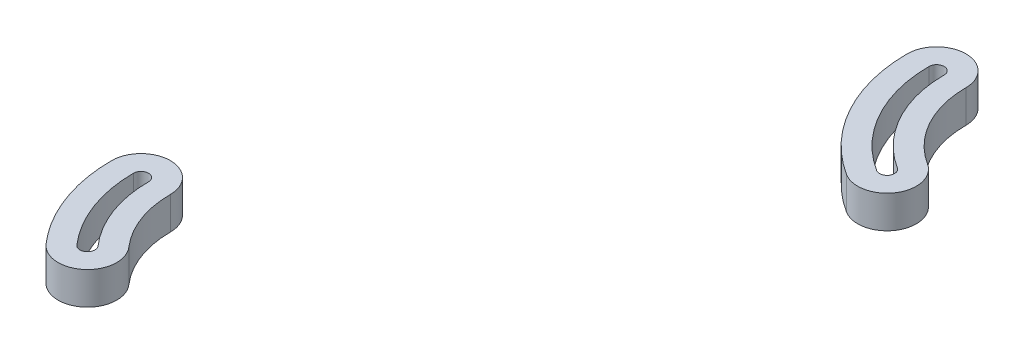
ISO-10303-21;
HEADER;
FILE_DESCRIPTION(('STEP AP214'),'2;1');
FILE_NAME('part.step','',(''),(''),'','','');
FILE_SCHEMA(('AUTOMOTIVE_DESIGN { 1 0 10303 214 1 1 1 1 }'));
ENDSEC;
DATA;
#1=APPLICATION_CONTEXT('core data for automotive mechanical design processes');
#2=APPLICATION_PROTOCOL_DEFINITION('international standard','automotive_design',2000,#1);
#3=PRODUCT_CONTEXT('',#1,'mechanical');
#4=PRODUCT('Part','Part','',(#3));
#5=PRODUCT_RELATED_PRODUCT_CATEGORY('part','',(#4));
#6=PRODUCT_DEFINITION_FORMATION('','',#4);
#7=PRODUCT_DEFINITION_CONTEXT('part definition',#1,'design');
#8=PRODUCT_DEFINITION('design','',#6,#7);
#9=PRODUCT_DEFINITION_SHAPE('','',#8);
#10=(LENGTH_UNIT() NAMED_UNIT(*) SI_UNIT(.MILLI.,.METRE.));
#11=(NAMED_UNIT(*) PLANE_ANGLE_UNIT() SI_UNIT($,.RADIAN.));
#12=(NAMED_UNIT(*) SI_UNIT($,.STERADIAN.) SOLID_ANGLE_UNIT());
#13=UNCERTAINTY_MEASURE_WITH_UNIT(LENGTH_MEASURE(1.E-05),#10,'distance_accuracy_value','');
#14=(GEOMETRIC_REPRESENTATION_CONTEXT(3) GLOBAL_UNCERTAINTY_ASSIGNED_CONTEXT((#13)) GLOBAL_UNIT_ASSIGNED_CONTEXT((#10,
#11,#12)) REPRESENTATION_CONTEXT('',''));
#15=CARTESIAN_POINT('',(0.,0.,0.));
#16=DIRECTION('',(0.,0.,1.));
#17=DIRECTION('',(1.,0.,0.));
#18=AXIS2_PLACEMENT_3D('',#15,#16,#17);
#19=CARTESIAN_POINT('',(-179.166238959109,445.3,-261.544556892225));
#20=DIRECTION('',(0.,1.,0.));
#21=DIRECTION('',(0.,0.,-1.));
#22=AXIS2_PLACEMENT_3D('',#19,#20,#21);
#23=CYLINDRICAL_SURFACE('',#22,49.);
#24=CARTESIAN_POINT('',(-179.166238959109,455.3,-261.544556892225));
#25=DIRECTION('',(0.,-1.,0.));
#26=DIRECTION('',(0.,0.,-1.));
#27=AXIS2_PLACEMENT_3D('',#24,#25,#26);
#28=CIRCLE('',#27,49.);
#29=CARTESIAN_POINT('',(-216.072963974037,455.3,-229.312683712521));
#30=VERTEX_POINT('',#29);
#31=CARTESIAN_POINT('',(-228.166238959109,455.3,-261.544556892225));
#32=VERTEX_POINT('',#31);
#33=EDGE_CURVE('E147',#30,#32,#28,.T.);
#34=ORIENTED_EDGE('',*,*,#33,.T.);
#35=DIRECTION('',(0.,1.,0.));
#36=VECTOR('',#35,1.);
#37=CARTESIAN_POINT('',(-228.166238959109,445.3,-261.544556892225));
#38=LINE('',#37,#36);
#39=CARTESIAN_POINT('',(-228.166238959109,445.3,-261.544556892225));
#40=VERTEX_POINT('',#39);
#41=EDGE_CURVE('E50',#40,#32,#38,.T.);
#42=ORIENTED_EDGE('',*,*,#41,.F.);
#43=CARTESIAN_POINT('',(-179.166238959109,445.3,-261.544556892225));
#44=DIRECTION('',(0.,-1.,0.));
#45=DIRECTION('',(0.,0.,-1.));
#46=AXIS2_PLACEMENT_3D('',#43,#44,#45);
#47=CIRCLE('',#46,49.);
#48=CARTESIAN_POINT('',(-216.072963974037,445.3,-229.312683712521));
#49=VERTEX_POINT('',#48);
#50=EDGE_CURVE('E151',#49,#40,#47,.T.);
#51=ORIENTED_EDGE('',*,*,#50,.F.);
#52=DIRECTION('',(0.,1.,0.));
#53=VECTOR('',#52,1.);
#54=CARTESIAN_POINT('',(-216.072963974037,445.3,-229.312683712521));
#55=LINE('',#54,#53);
#56=EDGE_CURVE('E12',#49,#30,#55,.T.);
#57=ORIENTED_EDGE('',*,*,#56,.T.);
#58=EDGE_LOOP('',(#34,#42,#51,#57));
#59=FACE_BOUND('',#58,.T.);
#60=ADVANCED_FACE('F47',(#59),#23,.T.);
#61=CARTESIAN_POINT('',(-209.294177746805,445.3,-235.232823684304));
#62=DIRECTION('',(0.,1.,0.));
#63=DIRECTION('',(0.,0.,-1.));
#64=AXIS2_PLACEMENT_3D('',#61,#62,#63);
#65=CYLINDRICAL_SURFACE('',#64,9.00000000000003);
#66=CARTESIAN_POINT('',(-209.294177746805,455.3,-235.232823684304));
#67=DIRECTION('',(0.,-1.,0.));
#68=DIRECTION('',(0.,0.,-1.));
#69=AXIS2_PLACEMENT_3D('',#66,#67,#68);
#70=CIRCLE('',#69,9.00000000000003);
#71=CARTESIAN_POINT('',(-202.515391519574,455.3,-241.152963656086));
#72=VERTEX_POINT('',#71);
#73=EDGE_CURVE('E155',#72,#30,#70,.T.);
#74=ORIENTED_EDGE('',*,*,#73,.T.);
#75=ORIENTED_EDGE('',*,*,#56,.F.);
#76=CARTESIAN_POINT('',(-209.294177746805,445.3,-235.232823684304));
#77=DIRECTION('',(0.,-1.,0.));
#78=DIRECTION('',(0.,0.,-1.));
#79=AXIS2_PLACEMENT_3D('',#76,#77,#78);
#80=CIRCLE('',#79,9.00000000000003);
#81=CARTESIAN_POINT('',(-202.515391519574,445.3,-241.152963656086));
#82=VERTEX_POINT('',#81);
#83=EDGE_CURVE('E159',#82,#49,#80,.T.);
#84=ORIENTED_EDGE('',*,*,#83,.F.);
#85=DIRECTION('',(0.,1.,0.));
#86=VECTOR('',#85,1.);
#87=CARTESIAN_POINT('',(-202.515391519574,445.3,-241.152963656086));
#88=LINE('',#87,#86);
#89=EDGE_CURVE('E55',#82,#72,#88,.T.);
#90=ORIENTED_EDGE('',*,*,#89,.T.);
#91=EDGE_LOOP('',(#74,#75,#84,#90));
#92=FACE_BOUND('',#91,.T.);
#93=ADVANCED_FACE('F190',(#92),#65,.T.);
#94=CARTESIAN_POINT('',(-179.166238959109,445.3,-261.544556892225));
#95=DIRECTION('',(0.,1.,0.));
#96=DIRECTION('',(0.,0.,-1.));
#97=AXIS2_PLACEMENT_3D('',#94,#95,#96);
#98=CYLINDRICAL_SURFACE('',#97,31.);
#99=CARTESIAN_POINT('',(-179.166238959109,455.3,-261.544556892225));
#100=DIRECTION('',(0.,1.,0.));
#101=DIRECTION('',(0.,0.,-1.));
#102=AXIS2_PLACEMENT_3D('',#99,#100,#101);
#103=CIRCLE('',#102,31.);
#104=CARTESIAN_POINT('',(-210.166238959109,455.3,-261.544556892225));
#105=VERTEX_POINT('',#104);
#106=EDGE_CURVE('E165',#105,#72,#103,.T.);
#107=ORIENTED_EDGE('',*,*,#106,.T.);
#108=ORIENTED_EDGE('',*,*,#89,.F.);
#109=CARTESIAN_POINT('',(-179.166238959109,445.3,-261.544556892225));
#110=DIRECTION('',(0.,1.,0.));
#111=DIRECTION('',(0.,0.,-1.));
#112=AXIS2_PLACEMENT_3D('',#109,#110,#111);
#113=CIRCLE('',#112,31.);
#114=CARTESIAN_POINT('',(-210.166238959109,445.3,-261.544556892225));
#115=VERTEX_POINT('',#114);
#116=EDGE_CURVE('E157',#115,#82,#113,.T.);
#117=ORIENTED_EDGE('',*,*,#116,.F.);
#118=DIRECTION('',(0.,1.,0.));
#119=VECTOR('',#118,1.);
#120=CARTESIAN_POINT('',(-210.166238959109,445.3,-261.544556892225));
#121=LINE('',#120,#119);
#122=EDGE_CURVE('E169',#115,#105,#121,.T.);
#123=ORIENTED_EDGE('',*,*,#122,.T.);
#124=EDGE_LOOP('',(#107,#108,#117,#123));
#125=FACE_BOUND('',#124,.T.);
#126=ADVANCED_FACE('F187',(#125),#98,.F.);
#127=CARTESIAN_POINT('',(-219.166238959109,445.3,-261.544556892225));
#128=DIRECTION('',(0.,1.,0.));
#129=DIRECTION('',(0.,0.,-1.));
#130=AXIS2_PLACEMENT_3D('',#127,#128,#129);
#131=CYLINDRICAL_SURFACE('',#130,9.00000000000001);
#132=CARTESIAN_POINT('',(-219.166238959109,455.3,-261.544556892225));
#133=DIRECTION('',(0.,-1.,0.));
#134=DIRECTION('',(0.,0.,-1.));
#135=AXIS2_PLACEMENT_3D('',#132,#133,#134);
#136=CIRCLE('',#135,9.00000000000001);
#137=EDGE_CURVE('E163',#32,#105,#136,.T.);
#138=ORIENTED_EDGE('',*,*,#137,.T.);
#139=ORIENTED_EDGE('',*,*,#122,.F.);
#140=CARTESIAN_POINT('',(-219.166238959109,445.3,-261.544556892225));
#141=DIRECTION('',(0.,-1.,0.));
#142=DIRECTION('',(0.,0.,-1.));
#143=AXIS2_PLACEMENT_3D('',#140,#141,#142);
#144=CIRCLE('',#143,9.00000000000001);
#145=EDGE_CURVE('E154',#40,#115,#144,.T.);
#146=ORIENTED_EDGE('',*,*,#145,.F.);
#147=ORIENTED_EDGE('',*,*,#41,.T.);
#148=EDGE_LOOP('',(#138,#139,#146,#147));
#149=FACE_BOUND('',#148,.T.);
#150=ADVANCED_FACE('F178',(#149),#131,.T.);
#151=CARTESIAN_POINT('',(-199.166238959109,445.3,-261.544556892225));
#152=DIRECTION('',(0.,1.,0.));
#153=DIRECTION('',(0.,0.,-1.));
#154=AXIS2_PLACEMENT_3D('',#151,#152,#153);
#155=PLANE('',#154);
#156=CARTESIAN_POINT('',(-209.294177746805,445.3,-235.232823684304));
#157=DIRECTION('',(0.,-1.,0.));
#158=DIRECTION('',(0.,0.,-1.));
#159=AXIS2_PLACEMENT_3D('',#156,#157,#158);
#160=CIRCLE('',#159,2.30000000000002);
#161=CARTESIAN_POINT('',(-207.561821266513,445.3,-236.745748343759));
#162=VERTEX_POINT('',#161);
#163=CARTESIAN_POINT('',(-211.026534227098,445.3,-233.719899024848));
#164=VERTEX_POINT('',#163);
#165=EDGE_CURVE('E120',#162,#164,#160,.T.);
#166=ORIENTED_EDGE('',*,*,#165,.F.);
#167=CARTESIAN_POINT('',(-179.166238959109,445.3,-261.544556892225));
#168=DIRECTION('',(0.,1.,0.));
#169=DIRECTION('',(0.,0.,-1.));
#170=AXIS2_PLACEMENT_3D('',#167,#168,#169);
#171=CIRCLE('',#170,37.7);
#172=CARTESIAN_POINT('',(-216.866238959109,445.3,-261.544556892225));
#173=VERTEX_POINT('',#172);
#174=EDGE_CURVE('E133',#173,#162,#171,.T.);
#175=ORIENTED_EDGE('',*,*,#174,.F.);
#176=CARTESIAN_POINT('',(-219.166238959109,445.3,-261.544556892225));
#177=DIRECTION('',(0.,-1.,0.));
#178=DIRECTION('',(0.,0.,-1.));
#179=AXIS2_PLACEMENT_3D('',#176,#177,#178);
#180=CIRCLE('',#179,2.30000000000002);
#181=CARTESIAN_POINT('',(-221.466238959109,445.3,-261.544556892225));
#182=VERTEX_POINT('',#181);
#183=EDGE_CURVE('E115',#182,#173,#180,.T.);
#184=ORIENTED_EDGE('',*,*,#183,.F.);
#185=CARTESIAN_POINT('',(-179.166238959109,445.3,-261.544556892225));
#186=DIRECTION('',(0.,-1.,0.));
#187=DIRECTION('',(0.,0.,-1.));
#188=AXIS2_PLACEMENT_3D('',#185,#186,#187);
#189=CIRCLE('',#188,42.3);
#190=EDGE_CURVE('E123',#164,#182,#189,.T.);
#191=ORIENTED_EDGE('',*,*,#190,.F.);
#192=EDGE_LOOP('',(#166,#175,#184,#191));
#193=FACE_BOUND('',#192,.T.);
#194=ORIENTED_EDGE('',*,*,#50,.T.);
#195=ORIENTED_EDGE('',*,*,#145,.T.);
#196=ORIENTED_EDGE('',*,*,#116,.T.);
#197=ORIENTED_EDGE('',*,*,#83,.T.);
#198=EDGE_LOOP('',(#194,#195,#196,#197));
#199=FACE_BOUND('',#198,.T.);
#200=ADVANCED_FACE('F131',(#193,#199),#155,.F.);
#201=CARTESIAN_POINT('',(-199.166238959109,455.3,-261.544556892225));
#202=DIRECTION('',(0.,1.,0.));
#203=DIRECTION('',(0.,0.,-1.));
#204=AXIS2_PLACEMENT_3D('',#201,#202,#203);
#205=PLANE('',#204);
#206=CARTESIAN_POINT('',(-179.166238959109,455.3,-261.544556892225));
#207=DIRECTION('',(0.,-1.,0.));
#208=DIRECTION('',(0.,0.,-1.));
#209=AXIS2_PLACEMENT_3D('',#206,#207,#208);
#210=CIRCLE('',#209,42.3);
#211=CARTESIAN_POINT('',(-211.026534227098,455.3,-233.719899024848));
#212=VERTEX_POINT('',#211);
#213=CARTESIAN_POINT('',(-221.466238959109,455.3,-261.544556892225));
#214=VERTEX_POINT('',#213);
#215=EDGE_CURVE('E138',#212,#214,#210,.T.);
#216=ORIENTED_EDGE('',*,*,#215,.T.);
#217=CARTESIAN_POINT('',(-219.166238959109,455.3,-261.544556892225));
#218=DIRECTION('',(0.,-1.,0.));
#219=DIRECTION('',(0.,0.,-1.));
#220=AXIS2_PLACEMENT_3D('',#217,#218,#219);
#221=CIRCLE('',#220,2.30000000000002);
#222=CARTESIAN_POINT('',(-216.866238959109,455.3,-261.544556892225));
#223=VERTEX_POINT('',#222);
#224=EDGE_CURVE('E118',#214,#223,#221,.T.);
#225=ORIENTED_EDGE('',*,*,#224,.T.);
#226=CARTESIAN_POINT('',(-179.166238959109,455.3,-261.544556892225));
#227=DIRECTION('',(0.,1.,0.));
#228=DIRECTION('',(0.,0.,-1.));
#229=AXIS2_PLACEMENT_3D('',#226,#227,#228);
#230=CIRCLE('',#229,37.7);
#231=CARTESIAN_POINT('',(-207.561821266513,455.3,-236.745748343759));
#232=VERTEX_POINT('',#231);
#233=EDGE_CURVE('E141',#223,#232,#230,.T.);
#234=ORIENTED_EDGE('',*,*,#233,.T.);
#235=CARTESIAN_POINT('',(-209.294177746805,455.3,-235.232823684304));
#236=DIRECTION('',(0.,-1.,0.));
#237=DIRECTION('',(0.,0.,-1.));
#238=AXIS2_PLACEMENT_3D('',#235,#236,#237);
#239=CIRCLE('',#238,2.30000000000002);
#240=EDGE_CURVE('E129',#232,#212,#239,.T.);
#241=ORIENTED_EDGE('',*,*,#240,.T.);
#242=EDGE_LOOP('',(#216,#225,#234,#241));
#243=FACE_BOUND('',#242,.T.);
#244=ORIENTED_EDGE('',*,*,#33,.F.);
#245=ORIENTED_EDGE('',*,*,#73,.F.);
#246=ORIENTED_EDGE('',*,*,#106,.F.);
#247=ORIENTED_EDGE('',*,*,#137,.F.);
#248=EDGE_LOOP('',(#244,#245,#246,#247));
#249=FACE_BOUND('',#248,.T.);
#250=ADVANCED_FACE('F185',(#243,#249),#205,.T.);
#251=CARTESIAN_POINT('',(-179.166238959109,445.3,-261.544556892225));
#252=DIRECTION('',(0.,1.,0.));
#253=DIRECTION('',(0.,0.,-1.));
#254=AXIS2_PLACEMENT_3D('',#251,#252,#253);
#255=CYLINDRICAL_SURFACE('',#254,42.3);
#256=ORIENTED_EDGE('',*,*,#215,.F.);
#257=DIRECTION('',(0.,1.,0.));
#258=VECTOR('',#257,1.);
#259=CARTESIAN_POINT('',(-211.026534227098,445.3,-233.719899024848));
#260=LINE('',#259,#258);
#261=EDGE_CURVE('E125',#164,#212,#260,.T.);
#262=ORIENTED_EDGE('',*,*,#261,.F.);
#263=ORIENTED_EDGE('',*,*,#190,.T.);
#264=DIRECTION('',(0.,1.,0.));
#265=VECTOR('',#264,1.);
#266=CARTESIAN_POINT('',(-221.466238959109,445.3,-261.544556892225));
#267=LINE('',#266,#265);
#268=EDGE_CURVE('E71',#182,#214,#267,.T.);
#269=ORIENTED_EDGE('',*,*,#268,.T.);
#270=EDGE_LOOP('',(#256,#262,#263,#269));
#271=FACE_BOUND('',#270,.T.);
#272=ADVANCED_FACE('F124',(#271),#255,.F.);
#273=CARTESIAN_POINT('',(-209.294177746805,445.3,-235.232823684304));
#274=DIRECTION('',(0.,1.,0.));
#275=DIRECTION('',(0.,0.,-1.));
#276=AXIS2_PLACEMENT_3D('',#273,#274,#275);
#277=CYLINDRICAL_SURFACE('',#276,2.30000000000002);
#278=ORIENTED_EDGE('',*,*,#240,.F.);
#279=DIRECTION('',(0.,1.,0.));
#280=VECTOR('',#279,1.);
#281=CARTESIAN_POINT('',(-207.561821266513,445.3,-236.745748343759));
#282=LINE('',#281,#280);
#283=EDGE_CURVE('E148',#162,#232,#282,.T.);
#284=ORIENTED_EDGE('',*,*,#283,.F.);
#285=ORIENTED_EDGE('',*,*,#165,.T.);
#286=ORIENTED_EDGE('',*,*,#261,.T.);
#287=EDGE_LOOP('',(#278,#284,#285,#286));
#288=FACE_BOUND('',#287,.T.);
#289=ADVANCED_FACE('F234',(#288),#277,.F.);
#290=CARTESIAN_POINT('',(-179.166238959109,445.3,-261.544556892225));
#291=DIRECTION('',(0.,1.,0.));
#292=DIRECTION('',(0.,0.,-1.));
#293=AXIS2_PLACEMENT_3D('',#290,#291,#292);
#294=CYLINDRICAL_SURFACE('',#293,37.7);
#295=ORIENTED_EDGE('',*,*,#233,.F.);
#296=DIRECTION('',(0.,1.,0.));
#297=VECTOR('',#296,1.);
#298=CARTESIAN_POINT('',(-216.866238959109,445.3,-261.544556892225));
#299=LINE('',#298,#297);
#300=EDGE_CURVE('E63',#173,#223,#299,.T.);
#301=ORIENTED_EDGE('',*,*,#300,.F.);
#302=ORIENTED_EDGE('',*,*,#174,.T.);
#303=ORIENTED_EDGE('',*,*,#283,.T.);
#304=EDGE_LOOP('',(#295,#301,#302,#303));
#305=FACE_BOUND('',#304,.T.);
#306=ADVANCED_FACE('F242',(#305),#294,.T.);
#307=CARTESIAN_POINT('',(-219.166238959109,445.3,-261.544556892225));
#308=DIRECTION('',(0.,1.,0.));
#309=DIRECTION('',(0.,0.,-1.));
#310=AXIS2_PLACEMENT_3D('',#307,#308,#309);
#311=CYLINDRICAL_SURFACE('',#310,2.30000000000002);
#312=ORIENTED_EDGE('',*,*,#224,.F.);
#313=ORIENTED_EDGE('',*,*,#268,.F.);
#314=ORIENTED_EDGE('',*,*,#183,.T.);
#315=ORIENTED_EDGE('',*,*,#300,.T.);
#316=EDGE_LOOP('',(#312,#313,#314,#315));
#317=FACE_BOUND('',#316,.T.);
#318=ADVANCED_FACE('F113',(#317),#311,.F.);
#319=CLOSED_SHELL('',(#60,#93,#126,#150,#200,#250,#272,#289,#306,#318));
#320=MANIFOLD_SOLID_BREP('B2',#319);
#321=CARTESIAN_POINT('',(-106.941386536485,445.3,-378.14410632055));
#322=DIRECTION('',(0.,1.,0.));
#323=DIRECTION('',(0.,0.,-1.));
#324=AXIS2_PLACEMENT_3D('',#321,#322,#323);
#325=CYLINDRICAL_SURFACE('',#324,9.00000000000001);
#326=CARTESIAN_POINT('',(-106.941386536485,455.3,-378.14410632055));
#327=DIRECTION('',(0.,-1.,0.));
#328=DIRECTION('',(0.,0.,-1.));
#329=AXIS2_PLACEMENT_3D('',#326,#327,#328);
#330=CIRCLE('',#329,9.00000000000001);
#331=CARTESIAN_POINT('',(-102.120119655251,455.3,-385.743802739482));
#332=VERTEX_POINT('',#331);
#333=CARTESIAN_POINT('',(-111.762653417718,455.3,-370.544409901618));
#334=VERTEX_POINT('',#333);
#335=EDGE_CURVE('E377',#332,#334,#330,.T.);
#336=ORIENTED_EDGE('',*,*,#335,.T.);
#337=DIRECTION('',(0.,1.,0.));
#338=VECTOR('',#337,1.);
#339=CARTESIAN_POINT('',(-111.762653417718,445.3,-370.544409901618));
#340=LINE('',#339,#338);
#341=CARTESIAN_POINT('',(-111.762653417718,445.3,-370.544409901618));
#342=VERTEX_POINT('',#341);
#343=EDGE_CURVE('E280',#342,#334,#340,.T.);
#344=ORIENTED_EDGE('',*,*,#343,.F.);
#345=CARTESIAN_POINT('',(-106.941386536485,445.3,-378.14410632055));
#346=DIRECTION('',(0.,-1.,0.));
#347=DIRECTION('',(0.,0.,-1.));
#348=AXIS2_PLACEMENT_3D('',#345,#346,#347);
#349=CIRCLE('',#348,9.00000000000001);
#350=CARTESIAN_POINT('',(-102.120119655251,445.3,-385.743802739482));
#351=VERTEX_POINT('',#350);
#352=EDGE_CURVE('E381',#351,#342,#349,.T.);
#353=ORIENTED_EDGE('',*,*,#352,.F.);
#354=DIRECTION('',(0.,1.,0.));
#355=VECTOR('',#354,1.);
#356=CARTESIAN_POINT('',(-102.120119655251,445.3,-385.743802739482));
#357=LINE('',#356,#355);
#358=EDGE_CURVE('E45',#351,#332,#357,.T.);
#359=ORIENTED_EDGE('',*,*,#358,.T.);
#360=EDGE_LOOP('',(#336,#344,#353,#359));
#361=FACE_BOUND('',#360,.T.);
#362=ADVANCED_FACE('F277',(#361),#325,.T.);
#363=CARTESIAN_POINT('',(-85.5135337310029,445.3,-411.920534849135));
#364=DIRECTION('',(0.,1.,0.));
#365=DIRECTION('',(0.,0.,-1.));
#366=AXIS2_PLACEMENT_3D('',#363,#364,#365);
#367=CYLINDRICAL_SURFACE('',#366,31.);
#368=CARTESIAN_POINT('',(-85.5135337310029,455.3,-411.920534849135));
#369=DIRECTION('',(0.,1.,0.));
#370=DIRECTION('',(0.,0.,-1.));
#371=AXIS2_PLACEMENT_3D('',#368,#369,#370);
#372=CIRCLE('',#371,31.);
#373=CARTESIAN_POINT('',(-116.513533731003,455.3,-411.920534849135));
#374=VERTEX_POINT('',#373);
#375=EDGE_CURVE('E385',#374,#332,#372,.T.);
#376=ORIENTED_EDGE('',*,*,#375,.T.);
#377=ORIENTED_EDGE('',*,*,#358,.F.);
#378=CARTESIAN_POINT('',(-85.5135337310029,445.3,-411.920534849135));
#379=DIRECTION('',(0.,1.,0.));
#380=DIRECTION('',(0.,0.,-1.));
#381=AXIS2_PLACEMENT_3D('',#378,#379,#380);
#382=CIRCLE('',#381,31.);
#383=CARTESIAN_POINT('',(-116.513533731003,445.3,-411.920534849135));
#384=VERTEX_POINT('',#383);
#385=EDGE_CURVE('E389',#384,#351,#382,.T.);
#386=ORIENTED_EDGE('',*,*,#385,.F.);
#387=DIRECTION('',(0.,1.,0.));
#388=VECTOR('',#387,1.);
#389=CARTESIAN_POINT('',(-116.513533731003,445.3,-411.920534849135));
#390=LINE('',#389,#388);
#391=EDGE_CURVE('E285',#384,#374,#390,.T.);
#392=ORIENTED_EDGE('',*,*,#391,.T.);
#393=EDGE_LOOP('',(#376,#377,#386,#392));
#394=FACE_BOUND('',#393,.T.);
#395=ADVANCED_FACE('F420',(#394),#367,.F.);
#396=CARTESIAN_POINT('',(-125.513533731003,445.3,-411.920534849135));
#397=DIRECTION('',(0.,1.,0.));
#398=DIRECTION('',(0.,0.,-1.));
#399=AXIS2_PLACEMENT_3D('',#396,#397,#398);
#400=CYLINDRICAL_SURFACE('',#399,9.00000000000001);
#401=CARTESIAN_POINT('',(-125.513533731003,455.3,-411.920534849135));
#402=DIRECTION('',(0.,-1.,0.));
#403=DIRECTION('',(0.,0.,-1.));
#404=AXIS2_PLACEMENT_3D('',#401,#402,#403);
#405=CIRCLE('',#404,9.00000000000001);
#406=CARTESIAN_POINT('',(-134.513533731003,455.3,-411.920534849135));
#407=VERTEX_POINT('',#406);
#408=EDGE_CURVE('E395',#407,#374,#405,.T.);
#409=ORIENTED_EDGE('',*,*,#408,.T.);
#410=ORIENTED_EDGE('',*,*,#391,.F.);
#411=CARTESIAN_POINT('',(-125.513533731003,445.3,-411.920534849135));
#412=DIRECTION('',(0.,-1.,0.));
#413=DIRECTION('',(0.,0.,-1.));
#414=AXIS2_PLACEMENT_3D('',#411,#412,#413);
#415=CIRCLE('',#414,9.00000000000001);
#416=CARTESIAN_POINT('',(-134.513533731003,445.3,-411.920534849135));
#417=VERTEX_POINT('',#416);
#418=EDGE_CURVE('E387',#417,#384,#415,.T.);
#419=ORIENTED_EDGE('',*,*,#418,.F.);
#420=DIRECTION('',(0.,1.,0.));
#421=VECTOR('',#420,1.);
#422=CARTESIAN_POINT('',(-134.513533731003,445.3,-411.920534849135));
#423=LINE('',#422,#421);
#424=EDGE_CURVE('E399',#417,#407,#423,.T.);
#425=ORIENTED_EDGE('',*,*,#424,.T.);
#426=EDGE_LOOP('',(#409,#410,#419,#425));
#427=FACE_BOUND('',#426,.T.);
#428=ADVANCED_FACE('F417',(#427),#400,.T.);
#429=CARTESIAN_POINT('',(-85.5135337310029,445.3,-411.920534849135));
#430=DIRECTION('',(0.,1.,0.));
#431=DIRECTION('',(0.,0.,-1.));
#432=AXIS2_PLACEMENT_3D('',#429,#430,#431);
#433=CYLINDRICAL_SURFACE('',#432,49.);
#434=CARTESIAN_POINT('',(-85.5135337310029,455.3,-411.920534849135));
#435=DIRECTION('',(0.,-1.,0.));
#436=DIRECTION('',(0.,0.,-1.));
#437=AXIS2_PLACEMENT_3D('',#434,#435,#436);
#438=CIRCLE('',#437,49.);
#439=EDGE_CURVE('E393',#334,#407,#438,.T.);
#440=ORIENTED_EDGE('',*,*,#439,.T.);
#441=ORIENTED_EDGE('',*,*,#424,.F.);
#442=CARTESIAN_POINT('',(-85.5135337310029,445.3,-411.920534849135));
#443=DIRECTION('',(0.,-1.,0.));
#444=DIRECTION('',(0.,0.,-1.));
#445=AXIS2_PLACEMENT_3D('',#442,#443,#444);
#446=CIRCLE('',#445,49.);
#447=EDGE_CURVE('E384',#342,#417,#446,.T.);
#448=ORIENTED_EDGE('',*,*,#447,.F.);
#449=ORIENTED_EDGE('',*,*,#343,.T.);
#450=EDGE_LOOP('',(#440,#441,#448,#449));
#451=FACE_BOUND('',#450,.T.);
#452=ADVANCED_FACE('F408',(#451),#433,.T.);
#453=CARTESIAN_POINT('',(-96.2274601337438,445.3,-395.032320584842));
#454=DIRECTION('',(0.,1.,0.));
#455=DIRECTION('',(0.,0.,-1.));
#456=AXIS2_PLACEMENT_3D('',#453,#454,#455);
#457=PLANE('',#456);
#458=CARTESIAN_POINT('',(-106.941386536485,445.3,-378.14410632055));
#459=DIRECTION('',(0.,-1.,0.));
#460=DIRECTION('',(0.,0.,-1.));
#461=AXIS2_PLACEMENT_3D('',#458,#459,#460);
#462=CIRCLE('',#461,2.29999999999998);
#463=CARTESIAN_POINT('',(-105.70928500017,445.3,-380.086250960944));
#464=VERTEX_POINT('',#463);
#465=CARTESIAN_POINT('',(-108.1734880728,445.3,-376.201961680156));
#466=VERTEX_POINT('',#465);
#467=EDGE_CURVE('E350',#464,#466,#462,.T.);
#468=ORIENTED_EDGE('',*,*,#467,.F.);
#469=CARTESIAN_POINT('',(-85.5135337310029,445.3,-411.920534849135));
#470=DIRECTION('',(0.,1.,0.));
#471=DIRECTION('',(0.,0.,-1.));
#472=AXIS2_PLACEMENT_3D('',#469,#470,#471);
#473=CIRCLE('',#472,37.7);
#474=CARTESIAN_POINT('',(-123.213533731003,445.3,-411.920534849135));
#475=VERTEX_POINT('',#474);
#476=EDGE_CURVE('E363',#475,#464,#473,.T.);
#477=ORIENTED_EDGE('',*,*,#476,.F.);
#478=CARTESIAN_POINT('',(-125.513533731003,445.3,-411.920534849135));
#479=DIRECTION('',(0.,-1.,0.));
#480=DIRECTION('',(0.,0.,-1.));
#481=AXIS2_PLACEMENT_3D('',#478,#479,#480);
#482=CIRCLE('',#481,2.3);
#483=CARTESIAN_POINT('',(-127.813533731003,445.3,-411.920534849135));
#484=VERTEX_POINT('',#483);
#485=EDGE_CURVE('E345',#484,#475,#482,.T.);
#486=ORIENTED_EDGE('',*,*,#485,.F.);
#487=CARTESIAN_POINT('',(-85.5135337310029,445.3,-411.920534849135));
#488=DIRECTION('',(0.,-1.,0.));
#489=DIRECTION('',(0.,0.,-1.));
#490=AXIS2_PLACEMENT_3D('',#487,#488,#489);
#491=CIRCLE('',#490,42.3);
#492=EDGE_CURVE('E353',#466,#484,#491,.T.);
#493=ORIENTED_EDGE('',*,*,#492,.F.);
#494=EDGE_LOOP('',(#468,#477,#486,#493));
#495=FACE_BOUND('',#494,.T.);
#496=ORIENTED_EDGE('',*,*,#352,.T.);
#497=ORIENTED_EDGE('',*,*,#447,.T.);
#498=ORIENTED_EDGE('',*,*,#418,.T.);
#499=ORIENTED_EDGE('',*,*,#385,.T.);
#500=EDGE_LOOP('',(#496,#497,#498,#499));
#501=FACE_BOUND('',#500,.T.);
#502=ADVANCED_FACE('F361',(#495,#501),#457,.F.);
#503=CARTESIAN_POINT('',(-96.2274601337438,455.3,-395.032320584842));
#504=DIRECTION('',(0.,1.,0.));
#505=DIRECTION('',(0.,0.,-1.));
#506=AXIS2_PLACEMENT_3D('',#503,#504,#505);
#507=PLANE('',#506);
#508=CARTESIAN_POINT('',(-85.5135337310029,455.3,-411.920534849135));
#509=DIRECTION('',(0.,-1.,0.));
#510=DIRECTION('',(0.,0.,-1.));
#511=AXIS2_PLACEMENT_3D('',#508,#509,#510);
#512=CIRCLE('',#511,42.3);
#513=CARTESIAN_POINT('',(-108.1734880728,455.3,-376.201961680156));
#514=VERTEX_POINT('',#513);
#515=CARTESIAN_POINT('',(-127.813533731003,455.3,-411.920534849135));
#516=VERTEX_POINT('',#515);
#517=EDGE_CURVE('E368',#514,#516,#512,.T.);
#518=ORIENTED_EDGE('',*,*,#517,.T.);
#519=CARTESIAN_POINT('',(-125.513533731003,455.3,-411.920534849135));
#520=DIRECTION('',(0.,-1.,0.));
#521=DIRECTION('',(0.,0.,-1.));
#522=AXIS2_PLACEMENT_3D('',#519,#520,#521);
#523=CIRCLE('',#522,2.3);
#524=CARTESIAN_POINT('',(-123.213533731003,455.3,-411.920534849135));
#525=VERTEX_POINT('',#524);
#526=EDGE_CURVE('E348',#516,#525,#523,.T.);
#527=ORIENTED_EDGE('',*,*,#526,.T.);
#528=CARTESIAN_POINT('',(-85.5135337310029,455.3,-411.920534849135));
#529=DIRECTION('',(0.,1.,0.));
#530=DIRECTION('',(0.,0.,-1.));
#531=AXIS2_PLACEMENT_3D('',#528,#529,#530);
#532=CIRCLE('',#531,37.7);
#533=CARTESIAN_POINT('',(-105.70928500017,455.3,-380.086250960944));
#534=VERTEX_POINT('',#533);
#535=EDGE_CURVE('E371',#525,#534,#532,.T.);
#536=ORIENTED_EDGE('',*,*,#535,.T.);
#537=CARTESIAN_POINT('',(-106.941386536485,455.3,-378.14410632055));
#538=DIRECTION('',(0.,-1.,0.));
#539=DIRECTION('',(0.,0.,-1.));
#540=AXIS2_PLACEMENT_3D('',#537,#538,#539);
#541=CIRCLE('',#540,2.29999999999998);
#542=EDGE_CURVE('E359',#534,#514,#541,.T.);
#543=ORIENTED_EDGE('',*,*,#542,.T.);
#544=EDGE_LOOP('',(#518,#527,#536,#543));
#545=FACE_BOUND('',#544,.T.);
#546=ORIENTED_EDGE('',*,*,#335,.F.);
#547=ORIENTED_EDGE('',*,*,#375,.F.);
#548=ORIENTED_EDGE('',*,*,#408,.F.);
#549=ORIENTED_EDGE('',*,*,#439,.F.);
#550=EDGE_LOOP('',(#546,#547,#548,#549));
#551=FACE_BOUND('',#550,.T.);
#552=ADVANCED_FACE('F415',(#545,#551),#507,.T.);
#553=CARTESIAN_POINT('',(-85.5135337310029,445.3,-411.920534849135));
#554=DIRECTION('',(0.,1.,0.));
#555=DIRECTION('',(0.,0.,-1.));
#556=AXIS2_PLACEMENT_3D('',#553,#554,#555);
#557=CYLINDRICAL_SURFACE('',#556,42.3);
#558=ORIENTED_EDGE('',*,*,#517,.F.);
#559=DIRECTION('',(0.,1.,0.));
#560=VECTOR('',#559,1.);
#561=CARTESIAN_POINT('',(-108.1734880728,445.3,-376.201961680156));
#562=LINE('',#561,#560);
#563=EDGE_CURVE('E355',#466,#514,#562,.T.);
#564=ORIENTED_EDGE('',*,*,#563,.F.);
#565=ORIENTED_EDGE('',*,*,#492,.T.);
#566=DIRECTION('',(0.,1.,0.));
#567=VECTOR('',#566,1.);
#568=CARTESIAN_POINT('',(-127.813533731003,445.3,-411.920534849135));
#569=LINE('',#568,#567);
#570=EDGE_CURVE('E301',#484,#516,#569,.T.);
#571=ORIENTED_EDGE('',*,*,#570,.T.);
#572=EDGE_LOOP('',(#558,#564,#565,#571));
#573=FACE_BOUND('',#572,.T.);
#574=ADVANCED_FACE('F354',(#573),#557,.F.);
#575=CARTESIAN_POINT('',(-106.941386536485,445.3,-378.14410632055));
#576=DIRECTION('',(0.,1.,0.));
#577=DIRECTION('',(0.,0.,-1.));
#578=AXIS2_PLACEMENT_3D('',#575,#576,#577);
#579=CYLINDRICAL_SURFACE('',#578,2.29999999999998);
#580=ORIENTED_EDGE('',*,*,#542,.F.);
#581=DIRECTION('',(0.,1.,0.));
#582=VECTOR('',#581,1.);
#583=CARTESIAN_POINT('',(-105.70928500017,445.3,-380.086250960944));
#584=LINE('',#583,#582);
#585=EDGE_CURVE('E378',#464,#534,#584,.T.);
#586=ORIENTED_EDGE('',*,*,#585,.F.);
#587=ORIENTED_EDGE('',*,*,#467,.T.);
#588=ORIENTED_EDGE('',*,*,#563,.T.);
#589=EDGE_LOOP('',(#580,#586,#587,#588));
#590=FACE_BOUND('',#589,.T.);
#591=ADVANCED_FACE('F464',(#590),#579,.F.);
#592=CARTESIAN_POINT('',(-85.5135337310029,445.3,-411.920534849135));
#593=DIRECTION('',(0.,1.,0.));
#594=DIRECTION('',(0.,0.,-1.));
#595=AXIS2_PLACEMENT_3D('',#592,#593,#594);
#596=CYLINDRICAL_SURFACE('',#595,37.7);
#597=ORIENTED_EDGE('',*,*,#535,.F.);
#598=DIRECTION('',(0.,1.,0.));
#599=VECTOR('',#598,1.);
#600=CARTESIAN_POINT('',(-123.213533731003,445.3,-411.920534849135));
#601=LINE('',#600,#599);
#602=EDGE_CURVE('E293',#475,#525,#601,.T.);
#603=ORIENTED_EDGE('',*,*,#602,.F.);
#604=ORIENTED_EDGE('',*,*,#476,.T.);
#605=ORIENTED_EDGE('',*,*,#585,.T.);
#606=EDGE_LOOP('',(#597,#603,#604,#605));
#607=FACE_BOUND('',#606,.T.);
#608=ADVANCED_FACE('F472',(#607),#596,.T.);
#609=CARTESIAN_POINT('',(-125.513533731003,445.3,-411.920534849135));
#610=DIRECTION('',(0.,1.,0.));
#611=DIRECTION('',(0.,0.,-1.));
#612=AXIS2_PLACEMENT_3D('',#609,#610,#611);
#613=CYLINDRICAL_SURFACE('',#612,2.3);
#614=ORIENTED_EDGE('',*,*,#526,.F.);
#615=ORIENTED_EDGE('',*,*,#570,.F.);
#616=ORIENTED_EDGE('',*,*,#485,.T.);
#617=ORIENTED_EDGE('',*,*,#602,.T.);
#618=EDGE_LOOP('',(#614,#615,#616,#617));
#619=FACE_BOUND('',#618,.T.);
#620=ADVANCED_FACE('F343',(#619),#613,.F.);
#621=CLOSED_SHELL('',(#362,#395,#428,#452,#502,#552,#574,#591,#608,#620));
#622=MANIFOLD_SOLID_BREP('B6',#621);
#623=ADVANCED_BREP_SHAPE_REPRESENTATION('',(#18,#320,#622),#14);
#624=SHAPE_DEFINITION_REPRESENTATION(#9,#623);
ENDSEC;
END-ISO-10303-21;
